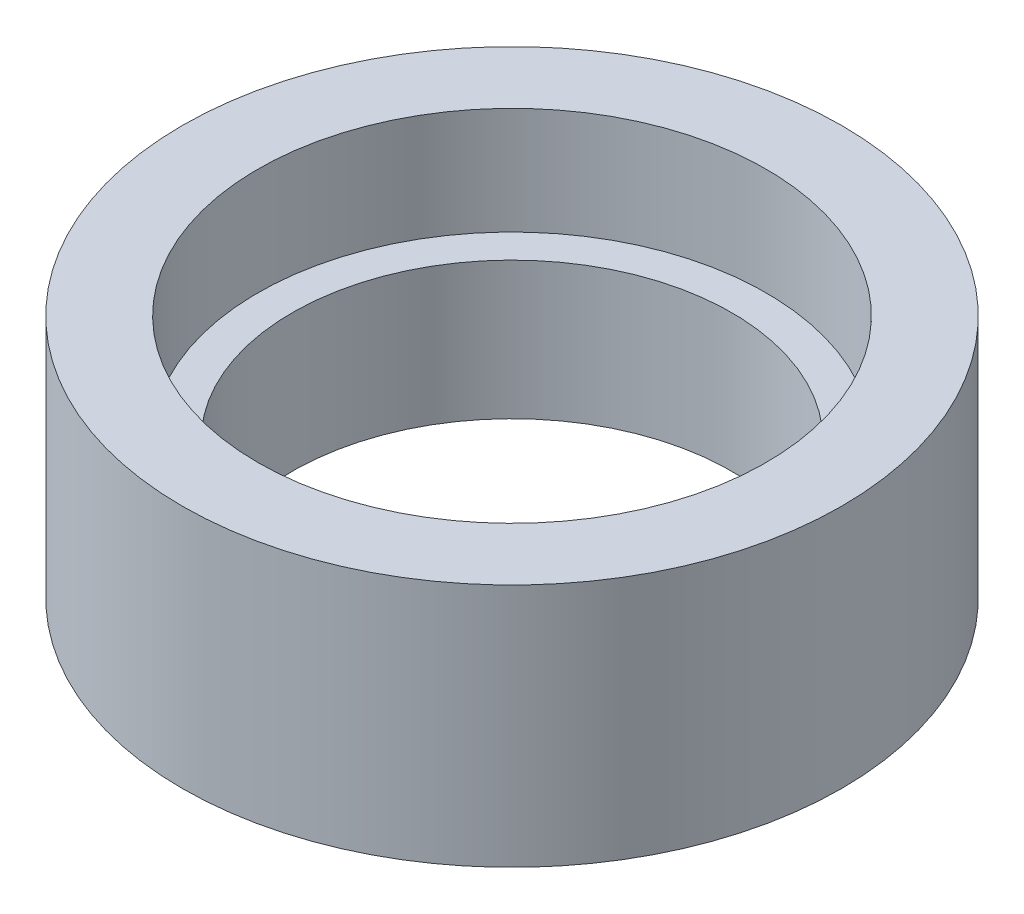
ISO-10303-21;
HEADER;
FILE_DESCRIPTION(('STEP AP214'),'2;1');
FILE_NAME('part.step','',(''),(''),'','','');
FILE_SCHEMA(('AUTOMOTIVE_DESIGN { 1 0 10303 214 1 1 1 1 }'));
ENDSEC;
DATA;
#1=APPLICATION_CONTEXT('core data for automotive mechanical design processes');
#2=APPLICATION_PROTOCOL_DEFINITION('international standard','automotive_design',2000,#1);
#3=PRODUCT_CONTEXT('',#1,'mechanical');
#4=PRODUCT('Part','Part','',(#3));
#5=PRODUCT_RELATED_PRODUCT_CATEGORY('part','',(#4));
#6=PRODUCT_DEFINITION_FORMATION('','',#4);
#7=PRODUCT_DEFINITION_CONTEXT('part definition',#1,'design');
#8=PRODUCT_DEFINITION('design','',#6,#7);
#9=PRODUCT_DEFINITION_SHAPE('','',#8);
#10=(LENGTH_UNIT() NAMED_UNIT(*) SI_UNIT(.MILLI.,.METRE.));
#11=(NAMED_UNIT(*) PLANE_ANGLE_UNIT() SI_UNIT($,.RADIAN.));
#12=(NAMED_UNIT(*) SI_UNIT($,.STERADIAN.) SOLID_ANGLE_UNIT());
#13=UNCERTAINTY_MEASURE_WITH_UNIT(LENGTH_MEASURE(1.E-05),#10,'distance_accuracy_value','');
#14=(GEOMETRIC_REPRESENTATION_CONTEXT(3) GLOBAL_UNCERTAINTY_ASSIGNED_CONTEXT((#13)) GLOBAL_UNIT_ASSIGNED_CONTEXT((#10,
#11,#12)) REPRESENTATION_CONTEXT('',''));
#15=CARTESIAN_POINT('',(0.,0.,0.));
#16=DIRECTION('',(0.,0.,1.));
#17=DIRECTION('',(1.,0.,0.));
#18=AXIS2_PLACEMENT_3D('',#15,#16,#17);
#19=CARTESIAN_POINT('',(0.,5.,0.));
#20=DIRECTION('',(0.,1.,0.));
#21=DIRECTION('',(0.,0.,1.));
#22=AXIS2_PLACEMENT_3D('',#19,#20,#21);
#23=PLANE('',#22);
#24=CARTESIAN_POINT('',(0.,5.,0.));
#25=DIRECTION('',(0.,1.,0.));
#26=DIRECTION('',(0.,0.,1.));
#27=AXIS2_PLACEMENT_3D('',#24,#25,#26);
#28=CIRCLE('',#27,8.);
#29=CARTESIAN_POINT('',(0.,5.,8.));
#30=VERTEX_POINT('',#29);
#31=EDGE_CURVE('E46',#30,#30,#28,.T.);
#32=ORIENTED_EDGE('',*,*,#31,.F.);
#33=EDGE_LOOP('',(#32));
#34=FACE_BOUND('',#33,.T.);
#35=CARTESIAN_POINT('',(0.,5.,0.));
#36=DIRECTION('',(0.,1.,0.));
#37=DIRECTION('',(0.,0.,1.));
#38=AXIS2_PLACEMENT_3D('',#35,#36,#37);
#39=CIRCLE('',#38,9.25);
#40=CARTESIAN_POINT('',(0.,5.,9.25));
#41=VERTEX_POINT('',#40);
#42=EDGE_CURVE('E60',#41,#41,#39,.T.);
#43=ORIENTED_EDGE('',*,*,#42,.T.);
#44=EDGE_LOOP('',(#43));
#45=FACE_BOUND('',#44,.T.);
#46=ADVANCED_FACE('F39',(#34,#45),#23,.T.);
#47=CARTESIAN_POINT('',(0.,0.,0.));
#48=DIRECTION('',(0.,1.,0.));
#49=DIRECTION('',(0.,0.,1.));
#50=AXIS2_PLACEMENT_3D('',#47,#48,#49);
#51=PLANE('',#50);
#52=CARTESIAN_POINT('',(0.,0.,0.));
#53=DIRECTION('',(0.,1.,0.));
#54=DIRECTION('',(0.,0.,1.));
#55=AXIS2_PLACEMENT_3D('',#52,#53,#54);
#56=CIRCLE('',#55,12.);
#57=CARTESIAN_POINT('',(0.,0.,12.));
#58=VERTEX_POINT('',#57);
#59=EDGE_CURVE('E10',#58,#58,#56,.T.);
#60=ORIENTED_EDGE('',*,*,#59,.F.);
#61=EDGE_LOOP('',(#60));
#62=FACE_BOUND('',#61,.T.);
#63=CARTESIAN_POINT('',(0.,0.,0.));
#64=DIRECTION('',(0.,1.,0.));
#65=DIRECTION('',(0.,0.,1.));
#66=AXIS2_PLACEMENT_3D('',#63,#64,#65);
#67=CIRCLE('',#66,8.);
#68=CARTESIAN_POINT('',(0.,0.,8.));
#69=VERTEX_POINT('',#68);
#70=EDGE_CURVE('E50',#69,#69,#67,.T.);
#71=ORIENTED_EDGE('',*,*,#70,.T.);
#72=EDGE_LOOP('',(#71));
#73=FACE_BOUND('',#72,.T.);
#74=ADVANCED_FACE('F82',(#62,#73),#51,.F.);
#75=CARTESIAN_POINT('',(0.,5.,0.));
#76=DIRECTION('',(0.,-1.,0.));
#77=DIRECTION('',(0.,0.,-1.));
#78=AXIS2_PLACEMENT_3D('',#75,#76,#77);
#79=CYLINDRICAL_SURFACE('',#78,12.);
#80=ORIENTED_EDGE('',*,*,#59,.T.);
#81=EDGE_LOOP('',(#80));
#82=FACE_BOUND('',#81,.T.);
#83=CARTESIAN_POINT('',(0.,8.9,0.));
#84=DIRECTION('',(0.,1.,0.));
#85=DIRECTION('',(0.,0.,1.));
#86=AXIS2_PLACEMENT_3D('',#83,#84,#85);
#87=CIRCLE('',#86,12.);
#88=CARTESIAN_POINT('',(0.,8.9,12.));
#89=VERTEX_POINT('',#88);
#90=EDGE_CURVE('E55',#89,#89,#87,.T.);
#91=ORIENTED_EDGE('',*,*,#90,.F.);
#92=EDGE_LOOP('',(#91));
#93=FACE_BOUND('',#92,.T.);
#94=ADVANCED_FACE('F41',(#82,#93),#79,.T.);
#95=CARTESIAN_POINT('',(0.,5.,0.));
#96=DIRECTION('',(0.,-1.,0.));
#97=DIRECTION('',(0.,0.,-1.));
#98=AXIS2_PLACEMENT_3D('',#95,#96,#97);
#99=CYLINDRICAL_SURFACE('',#98,8.);
#100=ORIENTED_EDGE('',*,*,#31,.T.);
#101=EDGE_LOOP('',(#100));
#102=FACE_BOUND('',#101,.T.);
#103=ORIENTED_EDGE('',*,*,#70,.F.);
#104=EDGE_LOOP('',(#103));
#105=FACE_BOUND('',#104,.T.);
#106=ADVANCED_FACE('F71',(#102,#105),#99,.F.);
#107=CARTESIAN_POINT('',(0.,8.9,0.));
#108=DIRECTION('',(0.,1.,0.));
#109=DIRECTION('',(0.,0.,1.));
#110=AXIS2_PLACEMENT_3D('',#107,#108,#109);
#111=PLANE('',#110);
#112=ORIENTED_EDGE('',*,*,#90,.T.);
#113=EDGE_LOOP('',(#112));
#114=FACE_BOUND('',#113,.T.);
#115=CARTESIAN_POINT('',(0.,8.9,0.));
#116=DIRECTION('',(0.,1.,0.));
#117=DIRECTION('',(0.,0.,1.));
#118=AXIS2_PLACEMENT_3D('',#115,#116,#117);
#119=CIRCLE('',#118,9.25);
#120=CARTESIAN_POINT('',(0.,8.9,9.25));
#121=VERTEX_POINT('',#120);
#122=EDGE_CURVE('E59',#121,#121,#119,.T.);
#123=ORIENTED_EDGE('',*,*,#122,.F.);
#124=EDGE_LOOP('',(#123));
#125=FACE_BOUND('',#124,.T.);
#126=ADVANCED_FACE('F69',(#114,#125),#111,.T.);
#127=CARTESIAN_POINT('',(0.,8.9,0.));
#128=DIRECTION('',(0.,-1.,0.));
#129=DIRECTION('',(0.,0.,-1.));
#130=AXIS2_PLACEMENT_3D('',#127,#128,#129);
#131=CYLINDRICAL_SURFACE('',#130,9.25);
#132=ORIENTED_EDGE('',*,*,#122,.T.);
#133=EDGE_LOOP('',(#132));
#134=FACE_BOUND('',#133,.T.);
#135=ORIENTED_EDGE('',*,*,#42,.F.);
#136=EDGE_LOOP('',(#135));
#137=FACE_BOUND('',#136,.T.);
#138=ADVANCED_FACE('F66',(#134,#137),#131,.F.);
#139=CLOSED_SHELL('',(#46,#74,#94,#106,#126,#138));
#140=MANIFOLD_SOLID_BREP('B2',#139);
#141=ADVANCED_BREP_SHAPE_REPRESENTATION('',(#18,#140),#14);
#142=SHAPE_DEFINITION_REPRESENTATION(#9,#141);
ENDSEC;
END-ISO-10303-21;
